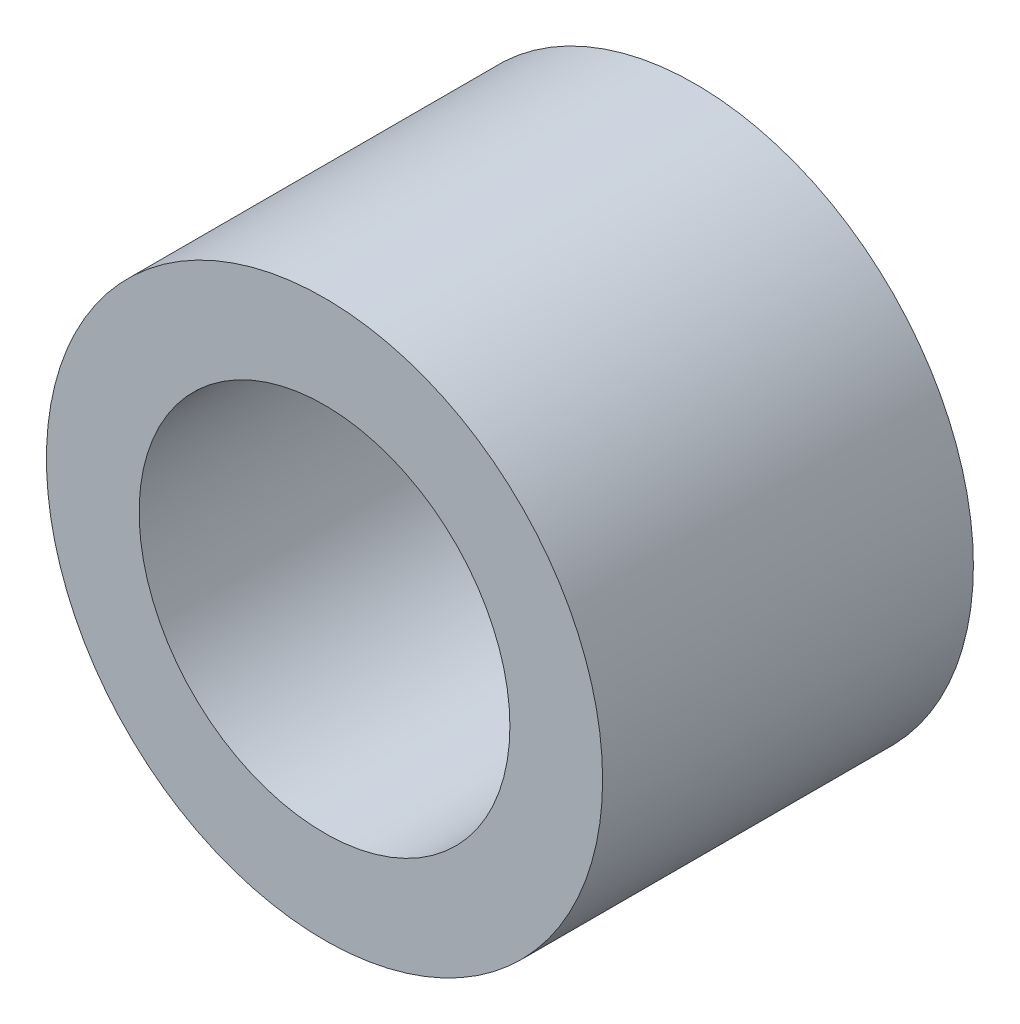
ISO-10303-21;
HEADER;
FILE_DESCRIPTION(('STEP AP214'),'2;1');
FILE_NAME('part.step','',(''),(''),'','','');
FILE_SCHEMA(('AUTOMOTIVE_DESIGN { 1 0 10303 214 1 1 1 1 }'));
ENDSEC;
DATA;
#1=APPLICATION_CONTEXT('core data for automotive mechanical design processes');
#2=APPLICATION_PROTOCOL_DEFINITION('international standard','automotive_design',2000,#1);
#3=PRODUCT_CONTEXT('',#1,'mechanical');
#4=PRODUCT('Part','Part','',(#3));
#5=PRODUCT_RELATED_PRODUCT_CATEGORY('part','',(#4));
#6=PRODUCT_DEFINITION_FORMATION('','',#4);
#7=PRODUCT_DEFINITION_CONTEXT('part definition',#1,'design');
#8=PRODUCT_DEFINITION('design','',#6,#7);
#9=PRODUCT_DEFINITION_SHAPE('','',#8);
#10=(LENGTH_UNIT() NAMED_UNIT(*) SI_UNIT(.MILLI.,.METRE.));
#11=(NAMED_UNIT(*) PLANE_ANGLE_UNIT() SI_UNIT($,.RADIAN.));
#12=(NAMED_UNIT(*) SI_UNIT($,.STERADIAN.) SOLID_ANGLE_UNIT());
#13=UNCERTAINTY_MEASURE_WITH_UNIT(LENGTH_MEASURE(1.E-05),#10,'distance_accuracy_value','');
#14=(GEOMETRIC_REPRESENTATION_CONTEXT(3) GLOBAL_UNCERTAINTY_ASSIGNED_CONTEXT((#13)) GLOBAL_UNIT_ASSIGNED_CONTEXT((#10,
#11,#12)) REPRESENTATION_CONTEXT('',''));
#15=CARTESIAN_POINT('',(0.,0.,0.));
#16=DIRECTION('',(0.,0.,1.));
#17=DIRECTION('',(1.,0.,0.));
#18=AXIS2_PLACEMENT_3D('',#15,#16,#17);
#19=CARTESIAN_POINT('',(0.,0.,4.));
#20=DIRECTION('',(0.,0.,1.));
#21=DIRECTION('',(1.,0.,0.));
#22=AXIS2_PLACEMENT_3D('',#19,#20,#21);
#23=PLANE('',#22);
#24=CARTESIAN_POINT('',(0.,0.,4.));
#25=DIRECTION('',(0.,0.,1.));
#26=DIRECTION('',(1.,0.,0.));
#27=AXIS2_PLACEMENT_3D('',#24,#25,#26);
#28=CIRCLE('',#27,6.);
#29=CARTESIAN_POINT('',(6.,0.,4.));
#30=VERTEX_POINT('',#29);
#31=EDGE_CURVE('E10',#30,#30,#28,.T.);
#32=ORIENTED_EDGE('',*,*,#31,.T.);
#33=EDGE_LOOP('',(#32));
#34=FACE_BOUND('',#33,.T.);
#35=CARTESIAN_POINT('',(0.,0.,4.));
#36=DIRECTION('',(0.,0.,1.));
#37=DIRECTION('',(1.,0.,0.));
#38=AXIS2_PLACEMENT_3D('',#35,#36,#37);
#39=CIRCLE('',#38,4.);
#40=CARTESIAN_POINT('',(4.,0.,4.));
#41=VERTEX_POINT('',#40);
#42=EDGE_CURVE('E41',#41,#41,#39,.T.);
#43=ORIENTED_EDGE('',*,*,#42,.F.);
#44=EDGE_LOOP('',(#43));
#45=FACE_BOUND('',#44,.T.);
#46=ADVANCED_FACE('F30',(#34,#45),#23,.T.);
#47=CARTESIAN_POINT('',(0.,0.,-4.));
#48=DIRECTION('',(0.,0.,1.));
#49=DIRECTION('',(1.,0.,0.));
#50=AXIS2_PLACEMENT_3D('',#47,#48,#49);
#51=PLANE('',#50);
#52=CARTESIAN_POINT('',(0.,0.,-4.));
#53=DIRECTION('',(0.,0.,1.));
#54=DIRECTION('',(1.,0.,0.));
#55=AXIS2_PLACEMENT_3D('',#52,#53,#54);
#56=CIRCLE('',#55,6.);
#57=CARTESIAN_POINT('',(6.,0.,-4.));
#58=VERTEX_POINT('',#57);
#59=EDGE_CURVE('E34',#58,#58,#56,.T.);
#60=ORIENTED_EDGE('',*,*,#59,.F.);
#61=EDGE_LOOP('',(#60));
#62=FACE_BOUND('',#61,.T.);
#63=CARTESIAN_POINT('',(0.,0.,-4.));
#64=DIRECTION('',(0.,0.,1.));
#65=DIRECTION('',(1.,0.,0.));
#66=AXIS2_PLACEMENT_3D('',#63,#64,#65);
#67=CIRCLE('',#66,4.);
#68=CARTESIAN_POINT('',(4.,0.,-4.));
#69=VERTEX_POINT('',#68);
#70=EDGE_CURVE('E43',#69,#69,#67,.T.);
#71=ORIENTED_EDGE('',*,*,#70,.T.);
#72=EDGE_LOOP('',(#71));
#73=FACE_BOUND('',#72,.T.);
#74=ADVANCED_FACE('F53',(#62,#73),#51,.F.);
#75=CARTESIAN_POINT('',(0.,0.,4.));
#76=DIRECTION('',(0.,0.,-1.));
#77=DIRECTION('',(-1.,0.,0.));
#78=AXIS2_PLACEMENT_3D('',#75,#76,#77);
#79=CYLINDRICAL_SURFACE('',#78,6.);
#80=ORIENTED_EDGE('',*,*,#31,.F.);
#81=EDGE_LOOP('',(#80));
#82=FACE_BOUND('',#81,.T.);
#83=ORIENTED_EDGE('',*,*,#59,.T.);
#84=EDGE_LOOP('',(#83));
#85=FACE_BOUND('',#84,.T.);
#86=ADVANCED_FACE('F32',(#82,#85),#79,.T.);
#87=CARTESIAN_POINT('',(0.,0.,4.));
#88=DIRECTION('',(0.,0.,-1.));
#89=DIRECTION('',(-1.,0.,0.));
#90=AXIS2_PLACEMENT_3D('',#87,#88,#89);
#91=CYLINDRICAL_SURFACE('',#90,4.);
#92=ORIENTED_EDGE('',*,*,#42,.T.);
#93=EDGE_LOOP('',(#92));
#94=FACE_BOUND('',#93,.T.);
#95=ORIENTED_EDGE('',*,*,#70,.F.);
#96=EDGE_LOOP('',(#95));
#97=FACE_BOUND('',#96,.T.);
#98=ADVANCED_FACE('F49',(#94,#97),#91,.F.);
#99=CLOSED_SHELL('',(#46,#74,#86,#98));
#100=MANIFOLD_SOLID_BREP('B2',#99);
#101=ADVANCED_BREP_SHAPE_REPRESENTATION('',(#18,#100),#14);
#102=SHAPE_DEFINITION_REPRESENTATION(#9,#101);
ENDSEC;
END-ISO-10303-21;
